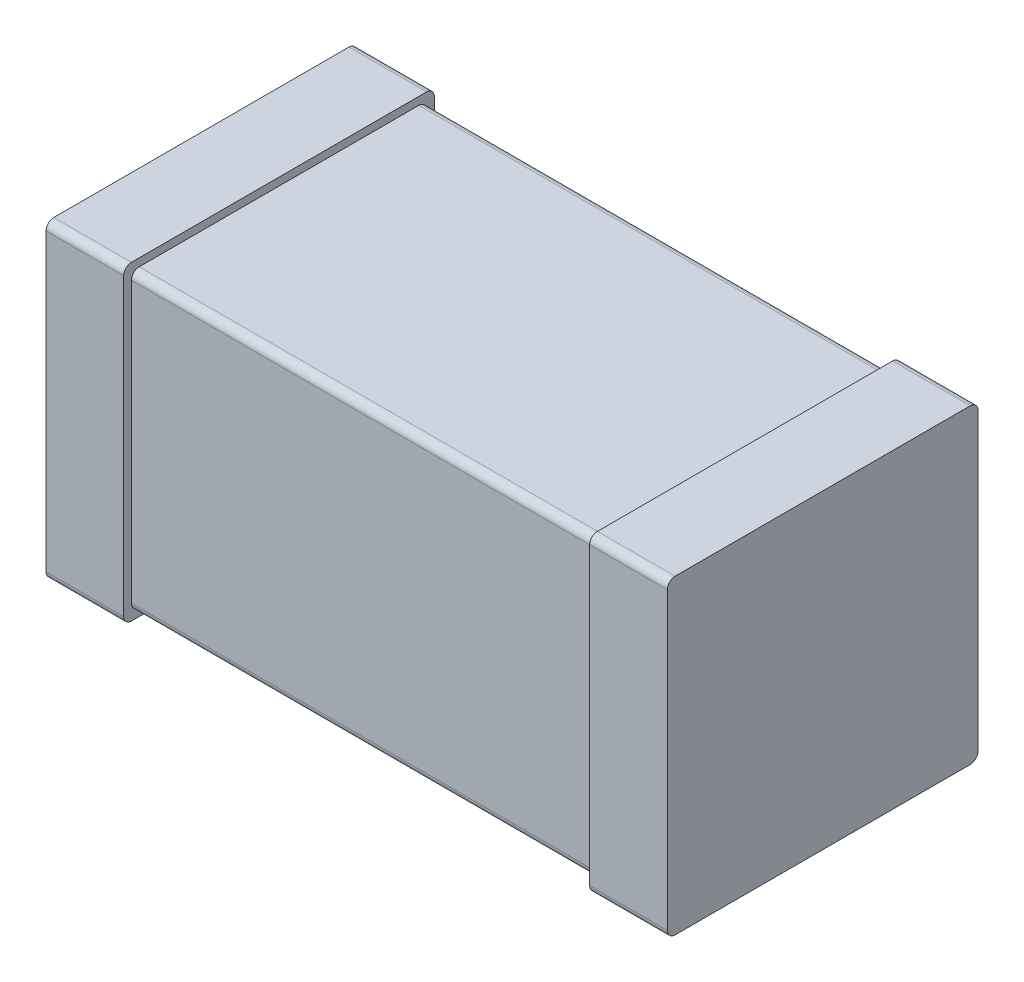
ISO-10303-21;
HEADER;
FILE_DESCRIPTION(('STEP AP214'),'2;1');
FILE_NAME('part.step','',(''),(''),'','','');
FILE_SCHEMA(('AUTOMOTIVE_DESIGN { 1 0 10303 214 1 1 1 1 }'));
ENDSEC;
DATA;
#1=APPLICATION_CONTEXT('core data for automotive mechanical design processes');
#2=APPLICATION_PROTOCOL_DEFINITION('international standard','automotive_design',2000,#1);
#3=PRODUCT_CONTEXT('',#1,'mechanical');
#4=PRODUCT('Part','Part','',(#3));
#5=PRODUCT_RELATED_PRODUCT_CATEGORY('part','',(#4));
#6=PRODUCT_DEFINITION_FORMATION('','',#4);
#7=PRODUCT_DEFINITION_CONTEXT('part definition',#1,'design');
#8=PRODUCT_DEFINITION('design','',#6,#7);
#9=PRODUCT_DEFINITION_SHAPE('','',#8);
#10=(LENGTH_UNIT() NAMED_UNIT(*) SI_UNIT(.MILLI.,.METRE.));
#11=(NAMED_UNIT(*) PLANE_ANGLE_UNIT() SI_UNIT($,.RADIAN.));
#12=(NAMED_UNIT(*) SI_UNIT($,.STERADIAN.) SOLID_ANGLE_UNIT());
#13=UNCERTAINTY_MEASURE_WITH_UNIT(LENGTH_MEASURE(1.E-05),#10,'distance_accuracy_value','');
#14=(GEOMETRIC_REPRESENTATION_CONTEXT(3) GLOBAL_UNCERTAINTY_ASSIGNED_CONTEXT((#13)) GLOBAL_UNIT_ASSIGNED_CONTEXT((#10,
#11,#12)) REPRESENTATION_CONTEXT('',''));
#15=CARTESIAN_POINT('',(0.,0.,0.));
#16=DIRECTION('',(0.,0.,1.));
#17=DIRECTION('',(1.,0.,0.));
#18=AXIS2_PLACEMENT_3D('',#15,#16,#17);
#19=CARTESIAN_POINT('',(-1.2,-0.76,1.56));
#20=DIRECTION('',(0.,0.,1.));
#21=DIRECTION('',(1.,0.,0.));
#22=AXIS2_PLACEMENT_3D('',#19,#20,#21);
#23=PLANE('',#22);
#24=DIRECTION('',(0.,1.,0.));
#25=VECTOR('',#24,1.);
#26=CARTESIAN_POINT('',(1.2,-0.76,1.56));
#27=LINE('',#26,#25);
#28=CARTESIAN_POINT('',(1.2,-0.72,1.56));
#29=VERTEX_POINT('',#28);
#30=CARTESIAN_POINT('',(1.2,0.72,1.56));
#31=VERTEX_POINT('',#30);
#32=EDGE_CURVE('E181',#29,#31,#27,.T.);
#33=ORIENTED_EDGE('',*,*,#32,.T.);
#34=DIRECTION('',(1.,0.,0.));
#35=VECTOR('',#34,1.);
#36=CARTESIAN_POINT('',(-1.2,0.72,1.56));
#37=LINE('',#36,#35);
#38=CARTESIAN_POINT('',(-1.2,0.72,1.56));
#39=VERTEX_POINT('',#38);
#40=EDGE_CURVE('E208',#39,#31,#37,.T.);
#41=ORIENTED_EDGE('',*,*,#40,.F.);
#42=DIRECTION('',(0.,1.,0.));
#43=VECTOR('',#42,1.);
#44=CARTESIAN_POINT('',(-1.2,-0.76,1.56));
#45=LINE('',#44,#43);
#46=CARTESIAN_POINT('',(-1.2,-0.72,1.56));
#47=VERTEX_POINT('',#46);
#48=EDGE_CURVE('E214',#39,#47,#45,.F.);
#49=ORIENTED_EDGE('',*,*,#48,.T.);
#50=DIRECTION('',(1.,0.,0.));
#51=VECTOR('',#50,1.);
#52=CARTESIAN_POINT('',(-1.2,-0.72,1.56));
#53=LINE('',#52,#51);
#54=EDGE_CURVE('E186',#29,#47,#53,.F.);
#55=ORIENTED_EDGE('',*,*,#54,.F.);
#56=EDGE_LOOP('',(#33,#41,#49,#55));
#57=FACE_BOUND('',#56,.T.);
#58=ADVANCED_FACE('F17',(#57),#23,.T.);
#59=CARTESIAN_POINT('',(-1.2,-0.72,1.52));
#60=DIRECTION('',(1.,0.,0.));
#61=DIRECTION('',(0.,0.,-1.));
#62=AXIS2_PLACEMENT_3D('',#59,#60,#61);
#63=CYLINDRICAL_SURFACE('',#62,0.04);
#64=ORIENTED_EDGE('',*,*,#54,.T.);
#65=CARTESIAN_POINT('',(-1.2,-0.72,1.52));
#66=DIRECTION('',(1.,0.,0.));
#67=DIRECTION('',(0.,0.,-1.));
#68=AXIS2_PLACEMENT_3D('',#65,#66,#67);
#69=CIRCLE('',#68,0.04);
#70=CARTESIAN_POINT('',(-1.2,-0.76,1.52));
#71=VERTEX_POINT('',#70);
#72=EDGE_CURVE('E199',#47,#71,#69,.T.);
#73=ORIENTED_EDGE('',*,*,#72,.T.);
#74=DIRECTION('',(1.,0.,0.));
#75=VECTOR('',#74,1.);
#76=CARTESIAN_POINT('',(-1.2,-0.76,1.52));
#77=LINE('',#76,#75);
#78=CARTESIAN_POINT('',(1.2,-0.76,1.52));
#79=VERTEX_POINT('',#78);
#80=EDGE_CURVE('E190',#71,#79,#77,.T.);
#81=ORIENTED_EDGE('',*,*,#80,.T.);
#82=CARTESIAN_POINT('',(1.2,-0.72,1.52));
#83=DIRECTION('',(1.,0.,0.));
#84=DIRECTION('',(0.,0.,-1.));
#85=AXIS2_PLACEMENT_3D('',#82,#83,#84);
#86=CIRCLE('',#85,0.04);
#87=EDGE_CURVE('E20',#79,#29,#86,.F.);
#88=ORIENTED_EDGE('',*,*,#87,.T.);
#89=EDGE_LOOP('',(#64,#73,#81,#88));
#90=FACE_BOUND('',#89,.T.);
#91=ADVANCED_FACE('F197',(#90),#63,.T.);
#92=CARTESIAN_POINT('',(1.6,-0.8,0.));
#93=DIRECTION('',(1.,0.,0.));
#94=DIRECTION('',(0.,0.,-1.));
#95=AXIS2_PLACEMENT_3D('',#92,#93,#94);
#96=PLANE('',#95);
#97=DIRECTION('',(0.,1.,0.));
#98=VECTOR('',#97,1.);
#99=CARTESIAN_POINT('',(1.6,-0.8,1.6));
#100=LINE('',#99,#98);
#101=CARTESIAN_POINT('',(1.6,-0.76,1.6));
#102=VERTEX_POINT('',#101);
#103=CARTESIAN_POINT('',(1.6,0.76,1.6));
#104=VERTEX_POINT('',#103);
#105=EDGE_CURVE('E403',#102,#104,#100,.T.);
#106=ORIENTED_EDGE('',*,*,#105,.F.);
#107=CARTESIAN_POINT('',(1.6,-0.76,1.56));
#108=DIRECTION('',(1.,0.,0.));
#109=DIRECTION('',(0.,0.,-1.));
#110=AXIS2_PLACEMENT_3D('',#107,#108,#109);
#111=CIRCLE('',#110,0.04);
#112=CARTESIAN_POINT('',(1.6,-0.8,1.56));
#113=VERTEX_POINT('',#112);
#114=EDGE_CURVE('E269',#113,#102,#111,.F.);
#115=ORIENTED_EDGE('',*,*,#114,.F.);
#116=DIRECTION('',(0.,0.,1.));
#117=VECTOR('',#116,1.);
#118=CARTESIAN_POINT('',(1.6,-0.8,0.));
#119=LINE('',#118,#117);
#120=CARTESIAN_POINT('',(1.6,-0.8,0.04));
#121=VERTEX_POINT('',#120);
#122=EDGE_CURVE('E438',#113,#121,#119,.F.);
#123=ORIENTED_EDGE('',*,*,#122,.T.);
#124=CARTESIAN_POINT('',(1.6,-0.76,0.04));
#125=DIRECTION('',(1.,0.,0.));
#126=DIRECTION('',(0.,0.,-1.));
#127=AXIS2_PLACEMENT_3D('',#124,#125,#126);
#128=CIRCLE('',#127,0.04);
#129=CARTESIAN_POINT('',(1.6,-0.76,0.));
#130=VERTEX_POINT('',#129);
#131=EDGE_CURVE('E195',#130,#121,#128,.F.);
#132=ORIENTED_EDGE('',*,*,#131,.F.);
#133=DIRECTION('',(0.,1.,0.));
#134=VECTOR('',#133,1.);
#135=CARTESIAN_POINT('',(1.6,-0.8,0.));
#136=LINE('',#135,#134);
#137=CARTESIAN_POINT('',(1.6,0.76,0.));
#138=VERTEX_POINT('',#137);
#139=EDGE_CURVE('E206',#130,#138,#136,.T.);
#140=ORIENTED_EDGE('',*,*,#139,.T.);
#141=CARTESIAN_POINT('',(1.6,0.76,0.04));
#142=DIRECTION('',(1.,0.,0.));
#143=DIRECTION('',(0.,0.,-1.));
#144=AXIS2_PLACEMENT_3D('',#141,#142,#143);
#145=CIRCLE('',#144,0.04);
#146=CARTESIAN_POINT('',(1.6,0.8,0.04));
#147=VERTEX_POINT('',#146);
#148=EDGE_CURVE('E277',#147,#138,#145,.F.);
#149=ORIENTED_EDGE('',*,*,#148,.F.);
#150=DIRECTION('',(0.,0.,1.));
#151=VECTOR('',#150,1.);
#152=CARTESIAN_POINT('',(1.6,0.8,0.));
#153=LINE('',#152,#151);
#154=CARTESIAN_POINT('',(1.6,0.8,1.56));
#155=VERTEX_POINT('',#154);
#156=EDGE_CURVE('E423',#155,#147,#153,.F.);
#157=ORIENTED_EDGE('',*,*,#156,.F.);
#158=CARTESIAN_POINT('',(1.6,0.76,1.56));
#159=DIRECTION('',(1.,0.,0.));
#160=DIRECTION('',(0.,0.,-1.));
#161=AXIS2_PLACEMENT_3D('',#158,#159,#160);
#162=CIRCLE('',#161,0.04);
#163=EDGE_CURVE('E273',#104,#155,#162,.F.);
#164=ORIENTED_EDGE('',*,*,#163,.F.);
#165=EDGE_LOOP('',(#106,#115,#123,#132,#140,#149,#157,#164));
#166=FACE_BOUND('',#165,.T.);
#167=ADVANCED_FACE('F300',(#166),#96,.T.);
#168=CARTESIAN_POINT('',(-1.2,0.72,1.52));
#169=DIRECTION('',(1.,0.,0.));
#170=DIRECTION('',(0.,0.,-1.));
#171=AXIS2_PLACEMENT_3D('',#168,#169,#170);
#172=CYLINDRICAL_SURFACE('',#171,0.04);
#173=CARTESIAN_POINT('',(1.2,0.72,1.52));
#174=DIRECTION('',(1.,0.,0.));
#175=DIRECTION('',(0.,0.,-1.));
#176=AXIS2_PLACEMENT_3D('',#173,#174,#175);
#177=CIRCLE('',#176,0.04);
#178=CARTESIAN_POINT('',(1.2,0.76,1.52));
#179=VERTEX_POINT('',#178);
#180=EDGE_CURVE('E211',#31,#179,#177,.F.);
#181=ORIENTED_EDGE('',*,*,#180,.T.);
#182=DIRECTION('',(1.,0.,0.));
#183=VECTOR('',#182,1.);
#184=CARTESIAN_POINT('',(-1.2,0.76,1.52));
#185=LINE('',#184,#183);
#186=CARTESIAN_POINT('',(-1.2,0.76,1.52));
#187=VERTEX_POINT('',#186);
#188=EDGE_CURVE('E291',#187,#179,#185,.T.);
#189=ORIENTED_EDGE('',*,*,#188,.F.);
#190=CARTESIAN_POINT('',(-1.2,0.72,1.52));
#191=DIRECTION('',(1.,0.,0.));
#192=DIRECTION('',(0.,0.,-1.));
#193=AXIS2_PLACEMENT_3D('',#190,#191,#192);
#194=CIRCLE('',#193,0.04);
#195=EDGE_CURVE('E212',#187,#39,#194,.T.);
#196=ORIENTED_EDGE('',*,*,#195,.T.);
#197=ORIENTED_EDGE('',*,*,#40,.T.);
#198=EDGE_LOOP('',(#181,#189,#196,#197));
#199=FACE_BOUND('',#198,.T.);
#200=ADVANCED_FACE('F288',(#199),#172,.T.);
#201=CARTESIAN_POINT('',(-1.6,-0.8,0.));
#202=DIRECTION('',(1.,0.,0.));
#203=DIRECTION('',(0.,0.,-1.));
#204=AXIS2_PLACEMENT_3D('',#201,#202,#203);
#205=PLANE('',#204);
#206=CARTESIAN_POINT('',(-1.6,-0.76,1.56));
#207=DIRECTION('',(1.,0.,0.));
#208=DIRECTION('',(0.,0.,-1.));
#209=AXIS2_PLACEMENT_3D('',#206,#207,#208);
#210=CIRCLE('',#209,0.04);
#211=CARTESIAN_POINT('',(-1.6,-0.76,1.6));
#212=VERTEX_POINT('',#211);
#213=CARTESIAN_POINT('',(-1.6,-0.8,1.56));
#214=VERTEX_POINT('',#213);
#215=EDGE_CURVE('E202',#212,#214,#210,.T.);
#216=ORIENTED_EDGE('',*,*,#215,.F.);
#217=DIRECTION('',(0.,1.,0.));
#218=VECTOR('',#217,1.);
#219=CARTESIAN_POINT('',(-1.6,-0.8,1.6));
#220=LINE('',#219,#218);
#221=CARTESIAN_POINT('',(-1.6,0.76,1.6));
#222=VERTEX_POINT('',#221);
#223=EDGE_CURVE('E427',#222,#212,#220,.F.);
#224=ORIENTED_EDGE('',*,*,#223,.F.);
#225=CARTESIAN_POINT('',(-1.6,0.76,1.56));
#226=DIRECTION('',(1.,0.,0.));
#227=DIRECTION('',(0.,0.,-1.));
#228=AXIS2_PLACEMENT_3D('',#225,#226,#227);
#229=CIRCLE('',#228,0.04);
#230=CARTESIAN_POINT('',(-1.6,0.8,1.56));
#231=VERTEX_POINT('',#230);
#232=EDGE_CURVE('E257',#231,#222,#229,.T.);
#233=ORIENTED_EDGE('',*,*,#232,.F.);
#234=DIRECTION('',(0.,0.,1.));
#235=VECTOR('',#234,1.);
#236=CARTESIAN_POINT('',(-1.6,0.8,0.));
#237=LINE('',#236,#235);
#238=CARTESIAN_POINT('',(-1.6,0.8,0.04));
#239=VERTEX_POINT('',#238);
#240=EDGE_CURVE('E260',#239,#231,#237,.T.);
#241=ORIENTED_EDGE('',*,*,#240,.F.);
#242=CARTESIAN_POINT('',(-1.6,0.76,0.04));
#243=DIRECTION('',(1.,0.,0.));
#244=DIRECTION('',(0.,0.,-1.));
#245=AXIS2_PLACEMENT_3D('',#242,#243,#244);
#246=CIRCLE('',#245,0.04);
#247=CARTESIAN_POINT('',(-1.6,0.76,0.));
#248=VERTEX_POINT('',#247);
#249=EDGE_CURVE('E261',#248,#239,#246,.T.);
#250=ORIENTED_EDGE('',*,*,#249,.F.);
#251=DIRECTION('',(0.,1.,0.));
#252=VECTOR('',#251,1.);
#253=CARTESIAN_POINT('',(-1.6,-0.8,0.));
#254=LINE('',#253,#252);
#255=CARTESIAN_POINT('',(-1.6,-0.76,0.));
#256=VERTEX_POINT('',#255);
#257=EDGE_CURVE('E434',#248,#256,#254,.F.);
#258=ORIENTED_EDGE('',*,*,#257,.T.);
#259=CARTESIAN_POINT('',(-1.6,-0.76,0.04));
#260=DIRECTION('',(1.,0.,0.));
#261=DIRECTION('',(0.,0.,-1.));
#262=AXIS2_PLACEMENT_3D('',#259,#260,#261);
#263=CIRCLE('',#262,0.04);
#264=CARTESIAN_POINT('',(-1.6,-0.8,0.04));
#265=VERTEX_POINT('',#264);
#266=EDGE_CURVE('E265',#265,#256,#263,.T.);
#267=ORIENTED_EDGE('',*,*,#266,.F.);
#268=DIRECTION('',(0.,0.,1.));
#269=VECTOR('',#268,1.);
#270=CARTESIAN_POINT('',(-1.6,-0.8,0.));
#271=LINE('',#270,#269);
#272=EDGE_CURVE('E268',#265,#214,#271,.T.);
#273=ORIENTED_EDGE('',*,*,#272,.T.);
#274=EDGE_LOOP('',(#216,#224,#233,#241,#250,#258,#267,#273));
#275=FACE_BOUND('',#274,.T.);
#276=ADVANCED_FACE('F391',(#275),#205,.F.);
#277=CARTESIAN_POINT('',(-1.2,-0.76,0.04));
#278=DIRECTION('',(0.,1.,0.));
#279=DIRECTION('',(0.,0.,1.));
#280=AXIS2_PLACEMENT_3D('',#277,#278,#279);
#281=PLANE('',#280);
#282=ORIENTED_EDGE('',*,*,#80,.F.);
#283=DIRECTION('',(0.,0.,1.));
#284=VECTOR('',#283,1.);
#285=CARTESIAN_POINT('',(-1.2,-0.76,0.04));
#286=LINE('',#285,#284);
#287=CARTESIAN_POINT('',(-1.2,-0.76,0.08));
#288=VERTEX_POINT('',#287);
#289=EDGE_CURVE('E200',#288,#71,#286,.T.);
#290=ORIENTED_EDGE('',*,*,#289,.F.);
#291=DIRECTION('',(1.,0.,0.));
#292=VECTOR('',#291,1.);
#293=CARTESIAN_POINT('',(-1.2,-0.76,0.08));
#294=LINE('',#293,#292);
#295=CARTESIAN_POINT('',(1.2,-0.76,0.08));
#296=VERTEX_POINT('',#295);
#297=EDGE_CURVE('E193',#296,#288,#294,.F.);
#298=ORIENTED_EDGE('',*,*,#297,.F.);
#299=DIRECTION('',(0.,0.,1.));
#300=VECTOR('',#299,1.);
#301=CARTESIAN_POINT('',(1.2,-0.76,0.04));
#302=LINE('',#301,#300);
#303=EDGE_CURVE('E178',#79,#296,#302,.F.);
#304=ORIENTED_EDGE('',*,*,#303,.F.);
#305=EDGE_LOOP('',(#282,#290,#298,#304));
#306=FACE_BOUND('',#305,.T.);
#307=ADVANCED_FACE('F189',(#306),#281,.F.);
#308=CARTESIAN_POINT('',(1.2,-0.76,0.04));
#309=DIRECTION('',(1.,0.,0.));
#310=DIRECTION('',(0.,0.,-1.));
#311=AXIS2_PLACEMENT_3D('',#308,#309,#310);
#312=CYLINDRICAL_SURFACE('',#311,0.04);
#313=ORIENTED_EDGE('',*,*,#131,.T.);
#314=DIRECTION('',(1.,0.,0.));
#315=VECTOR('',#314,1.);
#316=CARTESIAN_POINT('',(1.2,-0.8,0.04));
#317=LINE('',#316,#315);
#318=CARTESIAN_POINT('',(1.2,-0.8,0.04));
#319=VERTEX_POINT('',#318);
#320=EDGE_CURVE('E413',#121,#319,#317,.F.);
#321=ORIENTED_EDGE('',*,*,#320,.T.);
#322=CARTESIAN_POINT('',(1.2,-0.76,0.04));
#323=DIRECTION('',(1.,0.,0.));
#324=DIRECTION('',(0.,0.,-1.));
#325=AXIS2_PLACEMENT_3D('',#322,#323,#324);
#326=CIRCLE('',#325,0.04);
#327=CARTESIAN_POINT('',(1.2,-0.76,0.));
#328=VERTEX_POINT('',#327);
#329=EDGE_CURVE('E254',#319,#328,#326,.T.);
#330=ORIENTED_EDGE('',*,*,#329,.T.);
#331=DIRECTION('',(1.,0.,0.));
#332=VECTOR('',#331,1.);
#333=CARTESIAN_POINT('',(1.2,-0.76,0.));
#334=LINE('',#333,#332);
#335=EDGE_CURVE('E281',#328,#130,#334,.T.);
#336=ORIENTED_EDGE('',*,*,#335,.T.);
#337=EDGE_LOOP('',(#313,#321,#330,#336));
#338=FACE_BOUND('',#337,.T.);
#339=ADVANCED_FACE('F384',(#338),#312,.T.);
#340=CARTESIAN_POINT('',(1.2,-0.8,0.));
#341=DIRECTION('',(0.,0.,1.));
#342=DIRECTION('',(1.,0.,0.));
#343=AXIS2_PLACEMENT_3D('',#340,#341,#342);
#344=PLANE('',#343);
#345=DIRECTION('',(1.,0.,0.));
#346=VECTOR('',#345,1.);
#347=CARTESIAN_POINT('',(1.2,0.76,0.));
#348=LINE('',#347,#346);
#349=CARTESIAN_POINT('',(1.2,0.76,0.));
#350=VERTEX_POINT('',#349);
#351=EDGE_CURVE('E279',#138,#350,#348,.F.);
#352=ORIENTED_EDGE('',*,*,#351,.F.);
#353=ORIENTED_EDGE('',*,*,#139,.F.);
#354=ORIENTED_EDGE('',*,*,#335,.F.);
#355=DIRECTION('',(0.,1.,0.));
#356=VECTOR('',#355,1.);
#357=CARTESIAN_POINT('',(1.2,-0.8,0.));
#358=LINE('',#357,#356);
#359=EDGE_CURVE('E253',#328,#350,#358,.T.);
#360=ORIENTED_EDGE('',*,*,#359,.T.);
#361=EDGE_LOOP('',(#352,#353,#354,#360));
#362=FACE_BOUND('',#361,.T.);
#363=ADVANCED_FACE('F380',(#362),#344,.F.);
#364=CARTESIAN_POINT('',(1.2,0.76,0.04));
#365=DIRECTION('',(1.,0.,0.));
#366=DIRECTION('',(0.,0.,-1.));
#367=AXIS2_PLACEMENT_3D('',#364,#365,#366);
#368=CYLINDRICAL_SURFACE('',#367,0.04);
#369=ORIENTED_EDGE('',*,*,#351,.T.);
#370=CARTESIAN_POINT('',(1.2,0.76,0.04));
#371=DIRECTION('',(1.,0.,0.));
#372=DIRECTION('',(0.,0.,-1.));
#373=AXIS2_PLACEMENT_3D('',#370,#371,#372);
#374=CIRCLE('',#373,0.04);
#375=CARTESIAN_POINT('',(1.2,0.8,0.04));
#376=VERTEX_POINT('',#375);
#377=EDGE_CURVE('E250',#350,#376,#374,.T.);
#378=ORIENTED_EDGE('',*,*,#377,.T.);
#379=DIRECTION('',(1.,0.,0.));
#380=VECTOR('',#379,1.);
#381=CARTESIAN_POINT('',(1.2,0.8,0.04));
#382=LINE('',#381,#380);
#383=EDGE_CURVE('E276',#147,#376,#382,.F.);
#384=ORIENTED_EDGE('',*,*,#383,.F.);
#385=ORIENTED_EDGE('',*,*,#148,.T.);
#386=EDGE_LOOP('',(#369,#378,#384,#385));
#387=FACE_BOUND('',#386,.T.);
#388=ADVANCED_FACE('F376',(#387),#368,.T.);
#389=CARTESIAN_POINT('',(1.2,0.8,0.));
#390=DIRECTION('',(0.,1.,0.));
#391=DIRECTION('',(0.,0.,1.));
#392=AXIS2_PLACEMENT_3D('',#389,#390,#391);
#393=PLANE('',#392);
#394=DIRECTION('',(0.,0.,-1.));
#395=VECTOR('',#394,1.);
#396=CARTESIAN_POINT('',(1.2,0.8,0.));
#397=LINE('',#396,#395);
#398=CARTESIAN_POINT('',(1.2,0.8,1.56));
#399=VERTEX_POINT('',#398);
#400=EDGE_CURVE('E249',#376,#399,#397,.F.);
#401=ORIENTED_EDGE('',*,*,#400,.T.);
#402=DIRECTION('',(1.,0.,0.));
#403=VECTOR('',#402,1.);
#404=CARTESIAN_POINT('',(1.2,0.8,1.56));
#405=LINE('',#404,#403);
#406=EDGE_CURVE('E275',#155,#399,#405,.F.);
#407=ORIENTED_EDGE('',*,*,#406,.F.);
#408=ORIENTED_EDGE('',*,*,#156,.T.);
#409=ORIENTED_EDGE('',*,*,#383,.T.);
#410=EDGE_LOOP('',(#401,#407,#408,#409));
#411=FACE_BOUND('',#410,.T.);
#412=ADVANCED_FACE('F372',(#411),#393,.T.);
#413=CARTESIAN_POINT('',(1.2,0.76,1.56));
#414=DIRECTION('',(1.,0.,0.));
#415=DIRECTION('',(0.,0.,-1.));
#416=AXIS2_PLACEMENT_3D('',#413,#414,#415);
#417=CYLINDRICAL_SURFACE('',#416,0.04);
#418=ORIENTED_EDGE('',*,*,#163,.T.);
#419=ORIENTED_EDGE('',*,*,#406,.T.);
#420=CARTESIAN_POINT('',(1.2,0.76,1.56));
#421=DIRECTION('',(1.,0.,0.));
#422=DIRECTION('',(0.,0.,-1.));
#423=AXIS2_PLACEMENT_3D('',#420,#421,#422);
#424=CIRCLE('',#423,0.04);
#425=CARTESIAN_POINT('',(1.2,0.76,1.6));
#426=VERTEX_POINT('',#425);
#427=EDGE_CURVE('E246',#399,#426,#424,.T.);
#428=ORIENTED_EDGE('',*,*,#427,.T.);
#429=DIRECTION('',(1.,0.,0.));
#430=VECTOR('',#429,1.);
#431=CARTESIAN_POINT('',(1.2,0.76,1.6));
#432=LINE('',#431,#430);
#433=EDGE_CURVE('E272',#104,#426,#432,.F.);
#434=ORIENTED_EDGE('',*,*,#433,.F.);
#435=EDGE_LOOP('',(#418,#419,#428,#434));
#436=FACE_BOUND('',#435,.T.);
#437=ADVANCED_FACE('F368',(#436),#417,.T.);
#438=CARTESIAN_POINT('',(1.2,-0.8,1.6));
#439=DIRECTION('',(0.,0.,1.));
#440=DIRECTION('',(1.,0.,0.));
#441=AXIS2_PLACEMENT_3D('',#438,#439,#440);
#442=PLANE('',#441);
#443=ORIENTED_EDGE('',*,*,#105,.T.);
#444=ORIENTED_EDGE('',*,*,#433,.T.);
#445=DIRECTION('',(0.,1.,0.));
#446=VECTOR('',#445,1.);
#447=CARTESIAN_POINT('',(1.2,-0.8,1.6));
#448=LINE('',#447,#446);
#449=CARTESIAN_POINT('',(1.2,-0.76,1.6));
#450=VERTEX_POINT('',#449);
#451=EDGE_CURVE('E245',#426,#450,#448,.F.);
#452=ORIENTED_EDGE('',*,*,#451,.T.);
#453=DIRECTION('',(1.,0.,0.));
#454=VECTOR('',#453,1.);
#455=CARTESIAN_POINT('',(1.2,-0.76,1.6));
#456=LINE('',#455,#454);
#457=EDGE_CURVE('E271',#102,#450,#456,.F.);
#458=ORIENTED_EDGE('',*,*,#457,.F.);
#459=EDGE_LOOP('',(#443,#444,#452,#458));
#460=FACE_BOUND('',#459,.T.);
#461=ADVANCED_FACE('F364',(#460),#442,.T.);
#462=CARTESIAN_POINT('',(1.2,-0.76,1.56));
#463=DIRECTION('',(1.,0.,0.));
#464=DIRECTION('',(0.,0.,-1.));
#465=AXIS2_PLACEMENT_3D('',#462,#463,#464);
#466=CYLINDRICAL_SURFACE('',#465,0.04);
#467=ORIENTED_EDGE('',*,*,#457,.T.);
#468=CARTESIAN_POINT('',(1.2,-0.76,1.56));
#469=DIRECTION('',(1.,0.,0.));
#470=DIRECTION('',(0.,0.,-1.));
#471=AXIS2_PLACEMENT_3D('',#468,#469,#470);
#472=CIRCLE('',#471,0.04);
#473=CARTESIAN_POINT('',(1.2,-0.8,1.56));
#474=VERTEX_POINT('',#473);
#475=EDGE_CURVE('E241',#450,#474,#472,.T.);
#476=ORIENTED_EDGE('',*,*,#475,.T.);
#477=DIRECTION('',(1.,0.,0.));
#478=VECTOR('',#477,1.);
#479=CARTESIAN_POINT('',(1.2,-0.8,1.56));
#480=LINE('',#479,#478);
#481=EDGE_CURVE('E416',#474,#113,#480,.T.);
#482=ORIENTED_EDGE('',*,*,#481,.T.);
#483=ORIENTED_EDGE('',*,*,#114,.T.);
#484=EDGE_LOOP('',(#467,#476,#482,#483));
#485=FACE_BOUND('',#484,.T.);
#486=ADVANCED_FACE('F360',(#485),#466,.T.);
#487=CARTESIAN_POINT('',(1.2,-0.8,0.));
#488=DIRECTION('',(0.,1.,0.));
#489=DIRECTION('',(0.,0.,1.));
#490=AXIS2_PLACEMENT_3D('',#487,#488,#489);
#491=PLANE('',#490);
#492=ORIENTED_EDGE('',*,*,#481,.F.);
#493=DIRECTION('',(0.,0.,-1.));
#494=VECTOR('',#493,1.);
#495=CARTESIAN_POINT('',(1.2,-0.8,0.));
#496=LINE('',#495,#494);
#497=EDGE_CURVE('E244',#474,#319,#496,.T.);
#498=ORIENTED_EDGE('',*,*,#497,.T.);
#499=ORIENTED_EDGE('',*,*,#320,.F.);
#500=ORIENTED_EDGE('',*,*,#122,.F.);
#501=EDGE_LOOP('',(#492,#498,#499,#500));
#502=FACE_BOUND('',#501,.T.);
#503=ADVANCED_FACE('F356',(#502),#491,.F.);
#504=CARTESIAN_POINT('',(-1.2,0.76,0.04));
#505=DIRECTION('',(0.,1.,0.));
#506=DIRECTION('',(0.,0.,1.));
#507=AXIS2_PLACEMENT_3D('',#504,#505,#506);
#508=PLANE('',#507);
#509=DIRECTION('',(0.,0.,1.));
#510=VECTOR('',#509,1.);
#511=CARTESIAN_POINT('',(-1.2,0.76,0.04));
#512=LINE('',#511,#510);
#513=CARTESIAN_POINT('',(-1.2,0.76,0.08));
#514=VERTEX_POINT('',#513);
#515=EDGE_CURVE('E439',#514,#187,#512,.T.);
#516=ORIENTED_EDGE('',*,*,#515,.T.);
#517=ORIENTED_EDGE('',*,*,#188,.T.);
#518=DIRECTION('',(0.,0.,-1.));
#519=VECTOR('',#518,1.);
#520=CARTESIAN_POINT('',(1.2,0.76,0.));
#521=LINE('',#520,#519);
#522=CARTESIAN_POINT('',(1.2,0.76,0.08));
#523=VERTEX_POINT('',#522);
#524=EDGE_CURVE('E240',#179,#523,#521,.T.);
#525=ORIENTED_EDGE('',*,*,#524,.T.);
#526=DIRECTION('',(1.,0.,0.));
#527=VECTOR('',#526,1.);
#528=CARTESIAN_POINT('',(-1.2,0.76,0.08));
#529=LINE('',#528,#527);
#530=EDGE_CURVE('E237',#514,#523,#529,.T.);
#531=ORIENTED_EDGE('',*,*,#530,.F.);
#532=EDGE_LOOP('',(#516,#517,#525,#531));
#533=FACE_BOUND('',#532,.T.);
#534=ADVANCED_FACE('F352',(#533),#508,.T.);
#535=CARTESIAN_POINT('',(-1.6,-0.8,0.));
#536=DIRECTION('',(0.,1.,0.));
#537=DIRECTION('',(0.,0.,1.));
#538=AXIS2_PLACEMENT_3D('',#535,#536,#537);
#539=PLANE('',#538);
#540=DIRECTION('',(1.,0.,0.));
#541=VECTOR('',#540,1.);
#542=CARTESIAN_POINT('',(-1.6,-0.8,1.56));
#543=LINE('',#542,#541);
#544=CARTESIAN_POINT('',(-1.2,-0.8,1.56));
#545=VERTEX_POINT('',#544);
#546=EDGE_CURVE('E459',#214,#545,#543,.T.);
#547=ORIENTED_EDGE('',*,*,#546,.F.);
#548=ORIENTED_EDGE('',*,*,#272,.F.);
#549=DIRECTION('',(1.,0.,0.));
#550=VECTOR('',#549,1.);
#551=CARTESIAN_POINT('',(-1.6,-0.8,0.04));
#552=LINE('',#551,#550);
#553=CARTESIAN_POINT('',(-1.2,-0.8,0.04));
#554=VERTEX_POINT('',#553);
#555=EDGE_CURVE('E267',#554,#265,#552,.F.);
#556=ORIENTED_EDGE('',*,*,#555,.F.);
#557=DIRECTION('',(0.,0.,-1.));
#558=VECTOR('',#557,1.);
#559=CARTESIAN_POINT('',(-1.2,-0.8,0.));
#560=LINE('',#559,#558);
#561=EDGE_CURVE('E234',#545,#554,#560,.T.);
#562=ORIENTED_EDGE('',*,*,#561,.F.);
#563=EDGE_LOOP('',(#547,#548,#556,#562));
#564=FACE_BOUND('',#563,.T.);
#565=ADVANCED_FACE('F348',(#564),#539,.F.);
#566=CARTESIAN_POINT('',(-1.6,-0.76,0.04));
#567=DIRECTION('',(1.,0.,0.));
#568=DIRECTION('',(0.,0.,-1.));
#569=AXIS2_PLACEMENT_3D('',#566,#567,#568);
#570=CYLINDRICAL_SURFACE('',#569,0.04);
#571=CARTESIAN_POINT('',(-1.2,-0.76,0.04));
#572=DIRECTION('',(1.,0.,0.));
#573=DIRECTION('',(0.,0.,-1.));
#574=AXIS2_PLACEMENT_3D('',#571,#572,#573);
#575=CIRCLE('',#574,0.04);
#576=CARTESIAN_POINT('',(-1.2,-0.76,0.));
#577=VERTEX_POINT('',#576);
#578=EDGE_CURVE('E232',#554,#577,#575,.T.);
#579=ORIENTED_EDGE('',*,*,#578,.F.);
#580=ORIENTED_EDGE('',*,*,#555,.T.);
#581=ORIENTED_EDGE('',*,*,#266,.T.);
#582=DIRECTION('',(1.,0.,0.));
#583=VECTOR('',#582,1.);
#584=CARTESIAN_POINT('',(-1.6,-0.76,0.));
#585=LINE('',#584,#583);
#586=EDGE_CURVE('E437',#256,#577,#585,.T.);
#587=ORIENTED_EDGE('',*,*,#586,.T.);
#588=EDGE_LOOP('',(#579,#580,#581,#587));
#589=FACE_BOUND('',#588,.T.);
#590=ADVANCED_FACE('F344',(#589),#570,.T.);
#591=CARTESIAN_POINT('',(-1.6,-0.8,0.));
#592=DIRECTION('',(0.,0.,1.));
#593=DIRECTION('',(1.,0.,0.));
#594=AXIS2_PLACEMENT_3D('',#591,#592,#593);
#595=PLANE('',#594);
#596=DIRECTION('',(1.,0.,0.));
#597=VECTOR('',#596,1.);
#598=CARTESIAN_POINT('',(-1.6,0.76,0.));
#599=LINE('',#598,#597);
#600=CARTESIAN_POINT('',(-1.2,0.76,0.));
#601=VERTEX_POINT('',#600);
#602=EDGE_CURVE('E264',#601,#248,#599,.F.);
#603=ORIENTED_EDGE('',*,*,#602,.F.);
#604=DIRECTION('',(0.,1.,0.));
#605=VECTOR('',#604,1.);
#606=CARTESIAN_POINT('',(-1.2,-0.8,0.));
#607=LINE('',#606,#605);
#608=EDGE_CURVE('E231',#577,#601,#607,.T.);
#609=ORIENTED_EDGE('',*,*,#608,.F.);
#610=ORIENTED_EDGE('',*,*,#586,.F.);
#611=ORIENTED_EDGE('',*,*,#257,.F.);
#612=EDGE_LOOP('',(#603,#609,#610,#611));
#613=FACE_BOUND('',#612,.T.);
#614=ADVANCED_FACE('F340',(#613),#595,.F.);
#615=CARTESIAN_POINT('',(-1.6,0.76,0.04));
#616=DIRECTION('',(1.,0.,0.));
#617=DIRECTION('',(0.,0.,-1.));
#618=AXIS2_PLACEMENT_3D('',#615,#616,#617);
#619=CYLINDRICAL_SURFACE('',#618,0.04);
#620=ORIENTED_EDGE('',*,*,#602,.T.);
#621=ORIENTED_EDGE('',*,*,#249,.T.);
#622=DIRECTION('',(1.,0.,0.));
#623=VECTOR('',#622,1.);
#624=CARTESIAN_POINT('',(-1.6,0.8,0.04));
#625=LINE('',#624,#623);
#626=CARTESIAN_POINT('',(-1.2,0.8,0.04));
#627=VERTEX_POINT('',#626);
#628=EDGE_CURVE('E263',#627,#239,#625,.F.);
#629=ORIENTED_EDGE('',*,*,#628,.F.);
#630=CARTESIAN_POINT('',(-1.2,0.76,0.04));
#631=DIRECTION('',(1.,0.,0.));
#632=DIRECTION('',(0.,0.,-1.));
#633=AXIS2_PLACEMENT_3D('',#630,#631,#632);
#634=CIRCLE('',#633,0.04);
#635=EDGE_CURVE('E229',#601,#627,#634,.T.);
#636=ORIENTED_EDGE('',*,*,#635,.F.);
#637=EDGE_LOOP('',(#620,#621,#629,#636));
#638=FACE_BOUND('',#637,.T.);
#639=ADVANCED_FACE('F336',(#638),#619,.T.);
#640=CARTESIAN_POINT('',(-1.6,0.8,0.));
#641=DIRECTION('',(0.,1.,0.));
#642=DIRECTION('',(0.,0.,1.));
#643=AXIS2_PLACEMENT_3D('',#640,#641,#642);
#644=PLANE('',#643);
#645=ORIENTED_EDGE('',*,*,#240,.T.);
#646=DIRECTION('',(1.,0.,0.));
#647=VECTOR('',#646,1.);
#648=CARTESIAN_POINT('',(-1.6,0.8,1.56));
#649=LINE('',#648,#647);
#650=CARTESIAN_POINT('',(-1.2,0.8,1.56));
#651=VERTEX_POINT('',#650);
#652=EDGE_CURVE('E259',#651,#231,#649,.F.);
#653=ORIENTED_EDGE('',*,*,#652,.F.);
#654=DIRECTION('',(0.,0.,-1.));
#655=VECTOR('',#654,1.);
#656=CARTESIAN_POINT('',(-1.2,0.8,0.));
#657=LINE('',#656,#655);
#658=EDGE_CURVE('E228',#627,#651,#657,.F.);
#659=ORIENTED_EDGE('',*,*,#658,.F.);
#660=ORIENTED_EDGE('',*,*,#628,.T.);
#661=EDGE_LOOP('',(#645,#653,#659,#660));
#662=FACE_BOUND('',#661,.T.);
#663=ADVANCED_FACE('F332',(#662),#644,.T.);
#664=CARTESIAN_POINT('',(-1.6,0.76,1.56));
#665=DIRECTION('',(1.,0.,0.));
#666=DIRECTION('',(0.,0.,-1.));
#667=AXIS2_PLACEMENT_3D('',#664,#665,#666);
#668=CYLINDRICAL_SURFACE('',#667,0.04);
#669=CARTESIAN_POINT('',(-1.2,0.76,1.56));
#670=DIRECTION('',(1.,0.,0.));
#671=DIRECTION('',(0.,0.,-1.));
#672=AXIS2_PLACEMENT_3D('',#669,#670,#671);
#673=CIRCLE('',#672,0.04);
#674=CARTESIAN_POINT('',(-1.2,0.76,1.6));
#675=VERTEX_POINT('',#674);
#676=EDGE_CURVE('E226',#651,#675,#673,.T.);
#677=ORIENTED_EDGE('',*,*,#676,.F.);
#678=ORIENTED_EDGE('',*,*,#652,.T.);
#679=ORIENTED_EDGE('',*,*,#232,.T.);
#680=DIRECTION('',(1.,0.,0.));
#681=VECTOR('',#680,1.);
#682=CARTESIAN_POINT('',(-1.6,0.76,1.6));
#683=LINE('',#682,#681);
#684=EDGE_CURVE('E430',#675,#222,#683,.F.);
#685=ORIENTED_EDGE('',*,*,#684,.F.);
#686=EDGE_LOOP('',(#677,#678,#679,#685));
#687=FACE_BOUND('',#686,.T.);
#688=ADVANCED_FACE('F328',(#687),#668,.T.);
#689=CARTESIAN_POINT('',(-1.6,-0.8,1.6));
#690=DIRECTION('',(0.,0.,1.));
#691=DIRECTION('',(1.,0.,0.));
#692=AXIS2_PLACEMENT_3D('',#689,#690,#691);
#693=PLANE('',#692);
#694=DIRECTION('',(0.,1.,0.));
#695=VECTOR('',#694,1.);
#696=CARTESIAN_POINT('',(-1.2,-0.8,1.6));
#697=LINE('',#696,#695);
#698=CARTESIAN_POINT('',(-1.2,-0.76,1.6));
#699=VERTEX_POINT('',#698);
#700=EDGE_CURVE('E225',#675,#699,#697,.F.);
#701=ORIENTED_EDGE('',*,*,#700,.F.);
#702=ORIENTED_EDGE('',*,*,#684,.T.);
#703=ORIENTED_EDGE('',*,*,#223,.T.);
#704=DIRECTION('',(1.,0.,0.));
#705=VECTOR('',#704,1.);
#706=CARTESIAN_POINT('',(-1.6,-0.76,1.6));
#707=LINE('',#706,#705);
#708=EDGE_CURVE('E458',#699,#212,#707,.F.);
#709=ORIENTED_EDGE('',*,*,#708,.F.);
#710=EDGE_LOOP('',(#701,#702,#703,#709));
#711=FACE_BOUND('',#710,.T.);
#712=ADVANCED_FACE('F324',(#711),#693,.T.);
#713=CARTESIAN_POINT('',(-1.6,-0.76,1.56));
#714=DIRECTION('',(1.,0.,0.));
#715=DIRECTION('',(0.,0.,-1.));
#716=AXIS2_PLACEMENT_3D('',#713,#714,#715);
#717=CYLINDRICAL_SURFACE('',#716,0.04);
#718=ORIENTED_EDGE('',*,*,#708,.T.);
#719=ORIENTED_EDGE('',*,*,#215,.T.);
#720=ORIENTED_EDGE('',*,*,#546,.T.);
#721=CARTESIAN_POINT('',(-1.2,-0.76,1.56));
#722=DIRECTION('',(1.,0.,0.));
#723=DIRECTION('',(0.,0.,-1.));
#724=AXIS2_PLACEMENT_3D('',#721,#722,#723);
#725=CIRCLE('',#724,0.04);
#726=EDGE_CURVE('E222',#699,#545,#725,.T.);
#727=ORIENTED_EDGE('',*,*,#726,.F.);
#728=EDGE_LOOP('',(#718,#719,#720,#727));
#729=FACE_BOUND('',#728,.T.);
#730=ADVANCED_FACE('F320',(#729),#717,.T.);
#731=CARTESIAN_POINT('',(-1.2,-0.72,0.08));
#732=DIRECTION('',(1.,0.,0.));
#733=DIRECTION('',(0.,0.,-1.));
#734=AXIS2_PLACEMENT_3D('',#731,#732,#733);
#735=CYLINDRICAL_SURFACE('',#734,0.04);
#736=CARTESIAN_POINT('',(1.2,-0.72,0.08));
#737=DIRECTION('',(1.,0.,0.));
#738=DIRECTION('',(0.,0.,-1.));
#739=AXIS2_PLACEMENT_3D('',#736,#737,#738);
#740=CIRCLE('',#739,0.04);
#741=CARTESIAN_POINT('',(1.2,-0.72,0.04));
#742=VERTEX_POINT('',#741);
#743=EDGE_CURVE('E238',#742,#296,#740,.F.);
#744=ORIENTED_EDGE('',*,*,#743,.T.);
#745=ORIENTED_EDGE('',*,*,#297,.T.);
#746=CARTESIAN_POINT('',(-1.2,-0.72,0.08));
#747=DIRECTION('',(1.,0.,0.));
#748=DIRECTION('',(0.,0.,-1.));
#749=AXIS2_PLACEMENT_3D('',#746,#747,#748);
#750=CIRCLE('',#749,0.04);
#751=CARTESIAN_POINT('',(-1.2,-0.72,0.04));
#752=VERTEX_POINT('',#751);
#753=EDGE_CURVE('E219',#752,#288,#750,.F.);
#754=ORIENTED_EDGE('',*,*,#753,.F.);
#755=DIRECTION('',(1.,0.,0.));
#756=VECTOR('',#755,1.);
#757=CARTESIAN_POINT('',(-1.2,-0.72,0.04));
#758=LINE('',#757,#756);
#759=EDGE_CURVE('E218',#752,#742,#758,.T.);
#760=ORIENTED_EDGE('',*,*,#759,.T.);
#761=EDGE_LOOP('',(#744,#745,#754,#760));
#762=FACE_BOUND('',#761,.T.);
#763=ADVANCED_FACE('F317',(#762),#735,.T.);
#764=CARTESIAN_POINT('',(1.2,-0.8,0.));
#765=DIRECTION('',(1.,0.,0.));
#766=DIRECTION('',(0.,0.,-1.));
#767=AXIS2_PLACEMENT_3D('',#764,#765,#766);
#768=PLANE('',#767);
#769=DIRECTION('',(0.,1.,0.));
#770=VECTOR('',#769,1.);
#771=CARTESIAN_POINT('',(1.2,-0.76,0.04));
#772=LINE('',#771,#770);
#773=CARTESIAN_POINT('',(1.2,0.72,0.04));
#774=VERTEX_POINT('',#773);
#775=EDGE_CURVE('E484',#742,#774,#772,.T.);
#776=ORIENTED_EDGE('',*,*,#775,.T.);
#777=CARTESIAN_POINT('',(1.2,0.72,0.08));
#778=DIRECTION('',(1.,0.,0.));
#779=DIRECTION('',(0.,0.,-1.));
#780=AXIS2_PLACEMENT_3D('',#777,#778,#779);
#781=CIRCLE('',#780,0.04);
#782=EDGE_CURVE('E235',#523,#774,#781,.F.);
#783=ORIENTED_EDGE('',*,*,#782,.F.);
#784=ORIENTED_EDGE('',*,*,#524,.F.);
#785=ORIENTED_EDGE('',*,*,#180,.F.);
#786=ORIENTED_EDGE('',*,*,#32,.F.);
#787=ORIENTED_EDGE('',*,*,#87,.F.);
#788=ORIENTED_EDGE('',*,*,#303,.T.);
#789=ORIENTED_EDGE('',*,*,#743,.F.);
#790=EDGE_LOOP('',(#776,#783,#784,#785,#786,#787,#788,#789));
#791=FACE_BOUND('',#790,.T.);
#792=ORIENTED_EDGE('',*,*,#475,.F.);
#793=ORIENTED_EDGE('',*,*,#451,.F.);
#794=ORIENTED_EDGE('',*,*,#427,.F.);
#795=ORIENTED_EDGE('',*,*,#400,.F.);
#796=ORIENTED_EDGE('',*,*,#377,.F.);
#797=ORIENTED_EDGE('',*,*,#359,.F.);
#798=ORIENTED_EDGE('',*,*,#329,.F.);
#799=ORIENTED_EDGE('',*,*,#497,.F.);
#800=EDGE_LOOP('',(#792,#793,#794,#795,#796,#797,#798,#799));
#801=FACE_BOUND('',#800,.T.);
#802=ADVANCED_FACE('F176',(#791,#801),#768,.F.);
#803=CARTESIAN_POINT('',(-1.2,0.72,0.08));
#804=DIRECTION('',(1.,0.,0.));
#805=DIRECTION('',(0.,0.,-1.));
#806=AXIS2_PLACEMENT_3D('',#803,#804,#805);
#807=CYLINDRICAL_SURFACE('',#806,0.04);
#808=DIRECTION('',(1.,0.,0.));
#809=VECTOR('',#808,1.);
#810=CARTESIAN_POINT('',(-1.2,0.72,0.04));
#811=LINE('',#810,#809);
#812=CARTESIAN_POINT('',(-1.2,0.72,0.04));
#813=VERTEX_POINT('',#812);
#814=EDGE_CURVE('E26',#774,#813,#811,.F.);
#815=ORIENTED_EDGE('',*,*,#814,.T.);
#816=CARTESIAN_POINT('',(-1.2,0.72,0.08));
#817=DIRECTION('',(1.,0.,0.));
#818=DIRECTION('',(0.,0.,-1.));
#819=AXIS2_PLACEMENT_3D('',#816,#817,#818);
#820=CIRCLE('',#819,0.04);
#821=EDGE_CURVE('E34',#514,#813,#820,.F.);
#822=ORIENTED_EDGE('',*,*,#821,.F.);
#823=ORIENTED_EDGE('',*,*,#530,.T.);
#824=ORIENTED_EDGE('',*,*,#782,.T.);
#825=EDGE_LOOP('',(#815,#822,#823,#824));
#826=FACE_BOUND('',#825,.T.);
#827=ADVANCED_FACE('F308',(#826),#807,.T.);
#828=CARTESIAN_POINT('',(-1.2,-0.8,0.));
#829=DIRECTION('',(1.,0.,0.));
#830=DIRECTION('',(0.,0.,-1.));
#831=AXIS2_PLACEMENT_3D('',#828,#829,#830);
#832=PLANE('',#831);
#833=ORIENTED_EDGE('',*,*,#821,.T.);
#834=DIRECTION('',(0.,1.,0.));
#835=VECTOR('',#834,1.);
#836=CARTESIAN_POINT('',(-1.2,-0.76,0.04));
#837=LINE('',#836,#835);
#838=EDGE_CURVE('E11',#813,#752,#837,.F.);
#839=ORIENTED_EDGE('',*,*,#838,.T.);
#840=ORIENTED_EDGE('',*,*,#753,.T.);
#841=ORIENTED_EDGE('',*,*,#289,.T.);
#842=ORIENTED_EDGE('',*,*,#72,.F.);
#843=ORIENTED_EDGE('',*,*,#48,.F.);
#844=ORIENTED_EDGE('',*,*,#195,.F.);
#845=ORIENTED_EDGE('',*,*,#515,.F.);
#846=EDGE_LOOP('',(#833,#839,#840,#841,#842,#843,#844,#845));
#847=FACE_BOUND('',#846,.T.);
#848=ORIENTED_EDGE('',*,*,#700,.T.);
#849=ORIENTED_EDGE('',*,*,#726,.T.);
#850=ORIENTED_EDGE('',*,*,#561,.T.);
#851=ORIENTED_EDGE('',*,*,#578,.T.);
#852=ORIENTED_EDGE('',*,*,#608,.T.);
#853=ORIENTED_EDGE('',*,*,#635,.T.);
#854=ORIENTED_EDGE('',*,*,#658,.T.);
#855=ORIENTED_EDGE('',*,*,#676,.T.);
#856=EDGE_LOOP('',(#848,#849,#850,#851,#852,#853,#854,#855));
#857=FACE_BOUND('',#856,.T.);
#858=ADVANCED_FACE('F292',(#847,#857),#832,.T.);
#859=CARTESIAN_POINT('',(-1.2,-0.76,0.04));
#860=DIRECTION('',(0.,0.,1.));
#861=DIRECTION('',(1.,0.,0.));
#862=AXIS2_PLACEMENT_3D('',#859,#860,#861);
#863=PLANE('',#862);
#864=ORIENTED_EDGE('',*,*,#814,.F.);
#865=ORIENTED_EDGE('',*,*,#775,.F.);
#866=ORIENTED_EDGE('',*,*,#759,.F.);
#867=ORIENTED_EDGE('',*,*,#838,.F.);
#868=EDGE_LOOP('',(#864,#865,#866,#867));
#869=FACE_BOUND('',#868,.T.);
#870=ADVANCED_FACE('F301',(#869),#863,.F.);
#871=CLOSED_SHELL('',(#58,#91,#167,#200,#276,#307,#339,#363,#388,#412,#437,#461,#486,#503,#534,
#565,#590,#614,#639,#663,#688,#712,#730,#763,#802,#827,#858,#870));
#872=MANIFOLD_SOLID_BREP('B1',#871);
#873=ADVANCED_BREP_SHAPE_REPRESENTATION('',(#18,#872),#14);
#874=SHAPE_DEFINITION_REPRESENTATION(#9,#873);
ENDSEC;
END-ISO-10303-21;
